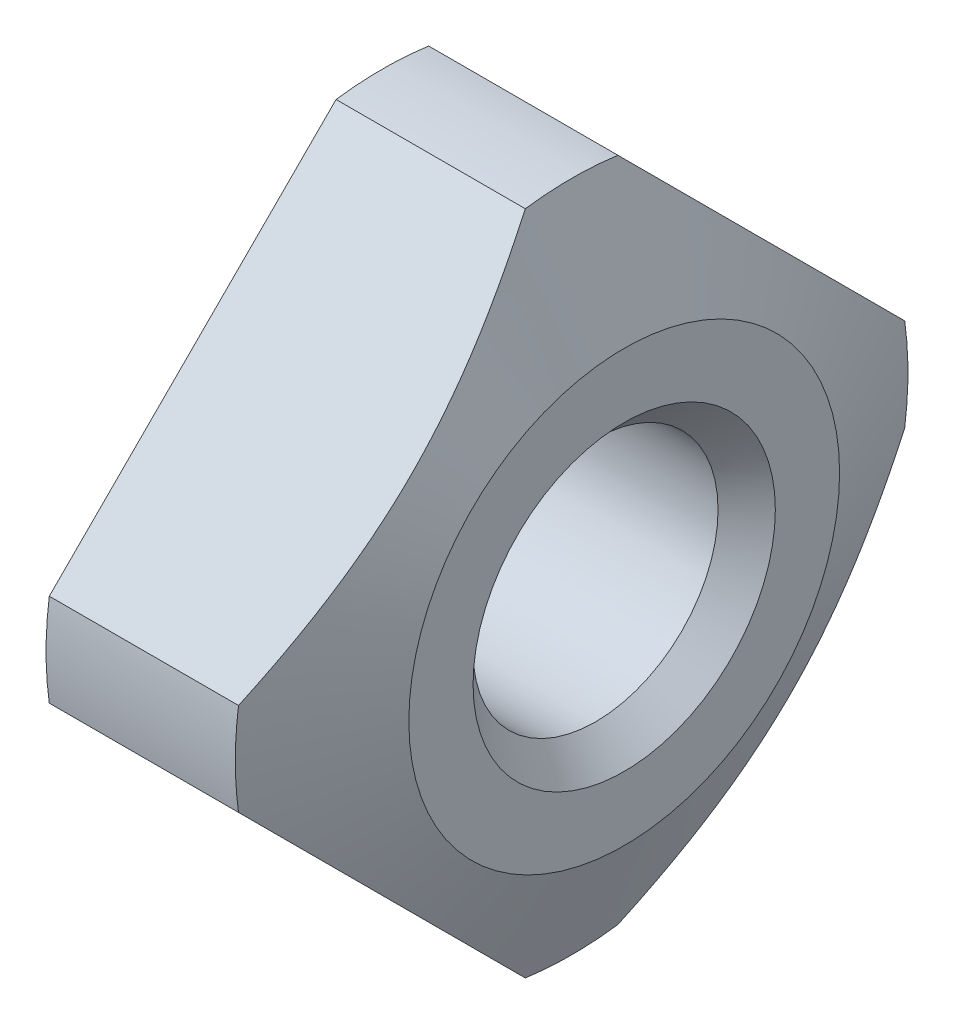
ISO-10303-21;
HEADER;
FILE_DESCRIPTION(('STEP AP214'),'2;1');
FILE_NAME('part.step','',(''),(''),'','','');
FILE_SCHEMA(('AUTOMOTIVE_DESIGN { 1 0 10303 214 1 1 1 1 }'));
ENDSEC;
DATA;
#1=APPLICATION_CONTEXT('core data for automotive mechanical design processes');
#2=APPLICATION_PROTOCOL_DEFINITION('international standard','automotive_design',2000,#1);
#3=PRODUCT_CONTEXT('',#1,'mechanical');
#4=PRODUCT('Part','Part','',(#3));
#5=PRODUCT_RELATED_PRODUCT_CATEGORY('part','',(#4));
#6=PRODUCT_DEFINITION_FORMATION('','',#4);
#7=PRODUCT_DEFINITION_CONTEXT('part definition',#1,'design');
#8=PRODUCT_DEFINITION('design','',#6,#7);
#9=PRODUCT_DEFINITION_SHAPE('','',#8);
#10=(LENGTH_UNIT() NAMED_UNIT(*) SI_UNIT(.MILLI.,.METRE.));
#11=(NAMED_UNIT(*) PLANE_ANGLE_UNIT() SI_UNIT($,.RADIAN.));
#12=(NAMED_UNIT(*) SI_UNIT($,.STERADIAN.) SOLID_ANGLE_UNIT());
#13=UNCERTAINTY_MEASURE_WITH_UNIT(LENGTH_MEASURE(1.E-05),#10,'distance_accuracy_value','');
#14=(GEOMETRIC_REPRESENTATION_CONTEXT(3) GLOBAL_UNCERTAINTY_ASSIGNED_CONTEXT((#13)) GLOBAL_UNIT_ASSIGNED_CONTEXT((#10,
#11,#12)) REPRESENTATION_CONTEXT('',''));
#15=CARTESIAN_POINT('',(0.,0.,0.));
#16=DIRECTION('',(0.,0.,1.));
#17=DIRECTION('',(1.,0.,0.));
#18=AXIS2_PLACEMENT_3D('',#15,#16,#17);
#19=CARTESIAN_POINT('',(0.,0.,0.));
#20=DIRECTION('',(1.,0.,0.));
#21=DIRECTION('',(0.,0.,-1.));
#22=AXIS2_PLACEMENT_3D('',#19,#20,#21);
#23=PLANE('',#22);
#24=CARTESIAN_POINT('',(0.,0.,0.));
#25=DIRECTION('',(-1.,0.,0.));
#26=DIRECTION('',(0.,0.,1.));
#27=AXIS2_PLACEMENT_3D('',#24,#25,#26);
#28=CIRCLE('',#27,2.);
#29=CARTESIAN_POINT('',(0.,0.,2.));
#30=VERTEX_POINT('',#29);
#31=EDGE_CURVE('E192',#30,#30,#28,.T.);
#32=ORIENTED_EDGE('',*,*,#31,.F.);
#33=EDGE_LOOP('',(#32));
#34=FACE_BOUND('',#33,.T.);
#35=DIRECTION('',(0.,0.707106781186548,-0.707106781186548));
#36=VECTOR('',#35,1.);
#37=CARTESIAN_POINT('',(0.,-5.0204581464245,0.));
#38=LINE('',#37,#36);
#39=CARTESIAN_POINT('',(0.,-4.40759566931327,-0.612862477111231));
#40=VERTEX_POINT('',#39);
#41=CARTESIAN_POINT('',(0.,-0.612862477111231,-4.40759566931327));
#42=VERTEX_POINT('',#41);
#43=EDGE_CURVE('E127',#40,#42,#38,.T.);
#44=ORIENTED_EDGE('',*,*,#43,.F.);
#45=CARTESIAN_POINT('',(0.,0.,0.));
#46=DIRECTION('',(1.,0.,0.));
#47=DIRECTION('',(0.,0.,-1.));
#48=AXIS2_PLACEMENT_3D('',#45,#46,#47);
#49=CIRCLE('',#48,4.45);
#50=CARTESIAN_POINT('',(0.,-4.40759566931327,0.612862477111231));
#51=VERTEX_POINT('',#50);
#52=EDGE_CURVE('E111',#51,#40,#49,.T.);
#53=ORIENTED_EDGE('',*,*,#52,.F.);
#54=DIRECTION('',(0.,-0.707106781186548,-0.707106781186548));
#55=VECTOR('',#54,1.);
#56=CARTESIAN_POINT('',(0.,0.,5.0204581464245));
#57=LINE('',#56,#55);
#58=CARTESIAN_POINT('',(0.,-0.612862477111231,4.40759566931327));
#59=VERTEX_POINT('',#58);
#60=EDGE_CURVE('E131',#59,#51,#57,.T.);
#61=ORIENTED_EDGE('',*,*,#60,.F.);
#62=CARTESIAN_POINT('',(0.,0.612862477111231,4.40759566931327));
#63=VERTEX_POINT('',#62);
#64=EDGE_CURVE('E191',#63,#59,#49,.T.);
#65=ORIENTED_EDGE('',*,*,#64,.F.);
#66=DIRECTION('',(0.,-0.707106781186548,0.707106781186548));
#67=VECTOR('',#66,1.);
#68=CARTESIAN_POINT('',(0.,5.0204581464245,0.));
#69=LINE('',#68,#67);
#70=CARTESIAN_POINT('',(0.,4.40759566931327,0.61286247711123));
#71=VERTEX_POINT('',#70);
#72=EDGE_CURVE('E186',#71,#63,#69,.T.);
#73=ORIENTED_EDGE('',*,*,#72,.F.);
#74=CARTESIAN_POINT('',(0.,4.40759566931327,-0.612862477111231));
#75=VERTEX_POINT('',#74);
#76=EDGE_CURVE('E113',#75,#71,#49,.T.);
#77=ORIENTED_EDGE('',*,*,#76,.F.);
#78=DIRECTION('',(0.,0.707106781186548,0.707106781186548));
#79=VECTOR('',#78,1.);
#80=CARTESIAN_POINT('',(0.,0.,-5.0204581464245));
#81=LINE('',#80,#79);
#82=CARTESIAN_POINT('',(0.,0.612862477111231,-4.40759566931327));
#83=VERTEX_POINT('',#82);
#84=EDGE_CURVE('E119',#83,#75,#81,.T.);
#85=ORIENTED_EDGE('',*,*,#84,.F.);
#86=EDGE_CURVE('E102',#42,#83,#49,.T.);
#87=ORIENTED_EDGE('',*,*,#86,.F.);
#88=EDGE_LOOP('',(#44,#53,#61,#65,#73,#77,#85,#87));
#89=FACE_BOUND('',#88,.T.);
#90=ADVANCED_FACE('F40',(#34,#89),#23,.F.);
#91=CARTESIAN_POINT('',(3.2,0.,0.));
#92=DIRECTION('',(-1.,0.,0.));
#93=DIRECTION('',(0.,0.,1.));
#94=AXIS2_PLACEMENT_3D('',#91,#92,#93);
#95=CONICAL_SURFACE('',#94,2.85,1.16064395257621);
#96=CARTESIAN_POINT('',(2.2868038164877,-0.0707564183643917,4.94970172806011));
#97=CARTESIAN_POINT('',(2.33172124276132,-0.175629833543289,4.84482831288121));
#98=CARTESIAN_POINT('',(2.37532571884489,-0.280797737176564,4.73966040924793));
#99=CARTESIAN_POINT('',(2.45916884939955,-0.491852861746213,4.52860528467829));
#100=CARTESIAN_POINT('',(2.49940593074332,-0.597740394168269,4.42271775225623));
#101=CARTESIAN_POINT('',(2.57596619918794,-0.810922171027619,4.20953597539688));
#102=CARTESIAN_POINT('',(2.61226375966969,-0.918221062617609,4.10223708380689));
#103=CARTESIAN_POINT('',(2.67968086783493,-1.13362415817683,3.88683398824767));
#104=CARTESIAN_POINT('',(2.71080102582585,-1.24172826565612,3.77872988076838));
#105=CARTESIAN_POINT('',(2.76589660904455,-1.45532814333493,3.56513000308957));
#106=CARTESIAN_POINT('',(2.79006656238547,-1.5607985271657,3.4596596192588));
#107=CARTESIAN_POINT('',(2.83151961411837,-1.77242313199955,3.24803501442495));
#108=CARTESIAN_POINT('',(2.84880278876683,-1.87857734541744,3.14188080100706));
#109=CARTESIAN_POINT('',(2.87556112631255,-2.09106300368001,2.92939514274449));
#110=CARTESIAN_POINT('',(2.88505963709065,-2.19739295304101,2.82306519338349));
#111=CARTESIAN_POINT('',(2.89578467244474,-2.41026098085396,2.61019716557054));
#112=CARTESIAN_POINT('',(2.89701157907088,-2.51679904946591,2.50365909695859));
#113=CARTESIAN_POINT('',(2.89137444268334,-2.72062964431911,2.29982850210539));
#114=CARTESIAN_POINT('',(2.88519481892413,-2.81793200472193,2.20252614170257));
#115=CARTESIAN_POINT('',(2.86617726847336,-3.01220324169428,2.00825490473021));
#116=CARTESIAN_POINT('',(2.85333925440001,-3.10917211387046,1.91128603255404));
#117=CARTESIAN_POINT('',(2.80559871635679,-3.39982544249197,1.62063270393253));
#118=CARTESIAN_POINT('',(2.76148799529713,-3.59277017149895,1.42768797492555));
#119=CARTESIAN_POINT('',(2.68072222571511,-3.88301579977745,1.13744234664705));
#120=CARTESIAN_POINT('',(2.650823433714,-3.98132808053403,1.03913006589047));
#121=CARTESIAN_POINT('',(2.58694571633892,-4.17730290293878,0.843155243485715));
#122=CARTESIAN_POINT('',(2.55296645868319,-4.27496539098846,0.74549275543604));
#123=CARTESIAN_POINT('',(2.48183476044907,-4.46913632719442,0.551321819230081));
#124=CARTESIAN_POINT('',(2.44470058064253,-4.56564816296429,0.454809983460211));
#125=CARTESIAN_POINT('',(2.36767842531259,-4.75808815979791,0.262369986626586));
#126=CARTESIAN_POINT('',(2.32779135446398,-4.85401650144327,0.166441644981227));
#127=CARTESIAN_POINT('',(2.2868038164877,-4.94970172806011,0.0707564183643922));
#128=B_SPLINE_CURVE_WITH_KNOTS('',3,(#96,#97,#98,#99,#100,#101,#102,#103,#104,#105,#106,#107,
#108,#109,#110,#111,#112,#113,#114,#115,#116,#117,#118,#119,#120,#121,#122,#123,#124,#125,#126,
#127),.UNSPECIFIED.,.F.,.F.,(4,2,2,2,2,2,2,2,2,2,2,2,2,2,2,4),(0.,0.464918768833228,
0.930053532708553,1.3980524940809,1.86599624901812,2.31916835039032,2.77233543370117,
3.22413834569543,3.6759203896033,4.08898265577631,4.50205034293433,5.33024224031278,
5.75684749571213,6.1834875141503,6.60780744323681,7.03198858719266),.UNSPECIFIED.);
#129=CARTESIAN_POINT('',(2.50430020006247,-0.612862477111231,4.40759566931327));
#130=VERTEX_POINT('',#129);
#131=CARTESIAN_POINT('',(2.50430020006269,-4.4075956693135,0.612862477111005));
#132=VERTEX_POINT('',#131);
#133=EDGE_CURVE('E169',#130,#132,#128,.T.);
#134=ORIENTED_EDGE('',*,*,#133,.T.);
#135=CARTESIAN_POINT('',(2.50430020006247,0.,0.));
#136=DIRECTION('',(-1.,0.,0.));
#137=DIRECTION('',(0.,0.,1.));
#138=AXIS2_PLACEMENT_3D('',#135,#136,#137);
#139=CIRCLE('',#138,4.45);
#140=CARTESIAN_POINT('',(2.50430020006247,-4.40759566931327,-0.612862477111231));
#141=VERTEX_POINT('',#140);
#142=EDGE_CURVE('E62',#132,#141,#139,.F.);
#143=ORIENTED_EDGE('',*,*,#142,.T.);
#144=CARTESIAN_POINT('',(2.2868038164877,-4.94970172806011,-0.0707564183643917));
#145=CARTESIAN_POINT('',(2.33172124276132,-4.84482831288121,-0.175629833543289));
#146=CARTESIAN_POINT('',(2.37532571884489,-4.73966040924793,-0.280797737176564));
#147=CARTESIAN_POINT('',(2.45916884939955,-4.52860528467829,-0.491852861746213));
#148=CARTESIAN_POINT('',(2.49940593074332,-4.42271775225623,-0.597740394168269));
#149=CARTESIAN_POINT('',(2.57596619918794,-4.20953597539688,-0.810922171027619));
#150=CARTESIAN_POINT('',(2.61226375966969,-4.10223708380689,-0.918221062617609));
#151=CARTESIAN_POINT('',(2.67968086783493,-3.88683398824767,-1.13362415817683));
#152=CARTESIAN_POINT('',(2.71080102582585,-3.77872988076838,-1.24172826565612));
#153=CARTESIAN_POINT('',(2.76589660904455,-3.56513000308957,-1.45532814333493));
#154=CARTESIAN_POINT('',(2.79006656238547,-3.4596596192588,-1.5607985271657));
#155=CARTESIAN_POINT('',(2.83151961411837,-3.24803501442495,-1.77242313199955));
#156=CARTESIAN_POINT('',(2.84880278876683,-3.14188080100706,-1.87857734541744));
#157=CARTESIAN_POINT('',(2.87556112631255,-2.92939514274449,-2.09106300368001));
#158=CARTESIAN_POINT('',(2.88505963709065,-2.82306519338349,-2.19739295304101));
#159=CARTESIAN_POINT('',(2.89578467244474,-2.61019716557054,-2.41026098085396));
#160=CARTESIAN_POINT('',(2.89701157907088,-2.50365909695859,-2.51679904946591));
#161=CARTESIAN_POINT('',(2.89137444268334,-2.29982850210539,-2.72062964431911));
#162=CARTESIAN_POINT('',(2.88519481892413,-2.20252614170257,-2.81793200472193));
#163=CARTESIAN_POINT('',(2.86617726847336,-2.00825490473021,-3.01220324169428));
#164=CARTESIAN_POINT('',(2.85333925440001,-1.91128603255404,-3.10917211387046));
#165=CARTESIAN_POINT('',(2.80559871635679,-1.62063270393253,-3.39982544249197));
#166=CARTESIAN_POINT('',(2.76148799529713,-1.42768797492555,-3.59277017149895));
#167=CARTESIAN_POINT('',(2.68072222571511,-1.13744234664705,-3.88301579977745));
#168=CARTESIAN_POINT('',(2.650823433714,-1.03913006589047,-3.98132808053403));
#169=CARTESIAN_POINT('',(2.58694571633892,-0.843155243485715,-4.17730290293878));
#170=CARTESIAN_POINT('',(2.55296645868319,-0.74549275543604,-4.27496539098846));
#171=CARTESIAN_POINT('',(2.48183476044907,-0.551321819230081,-4.46913632719442));
#172=CARTESIAN_POINT('',(2.44470058064253,-0.454809983460211,-4.56564816296429));
#173=CARTESIAN_POINT('',(2.36767842531259,-0.262369986626586,-4.75808815979791));
#174=CARTESIAN_POINT('',(2.32779135446398,-0.166441644981227,-4.85401650144327));
#175=CARTESIAN_POINT('',(2.2868038164877,-0.0707564183643922,-4.94970172806011));
#176=B_SPLINE_CURVE_WITH_KNOTS('',3,(#144,#145,#146,#147,#148,#149,#150,#151,#152,#153,#154,
#155,#156,#157,#158,#159,#160,#161,#162,#163,#164,#165,#166,#167,#168,#169,#170,#171,#172,#173,
#174,#175),.UNSPECIFIED.,.F.,.F.,(4,2,2,2,2,2,2,2,2,2,2,2,2,2,2,4),(0.,0.464918768833228,
0.930053532708553,1.3980524940809,1.86599624901812,2.31916835039032,2.77233543370117,
3.22413834569543,3.6759203896033,4.08898265577631,4.50205034293433,5.33024224031278,
5.75684749571213,6.1834875141503,6.60780744323681,7.03198858719266),.UNSPECIFIED.);
#177=CARTESIAN_POINT('',(2.50430020006269,-0.612862477111005,-4.4075956693135));
#178=VERTEX_POINT('',#177);
#179=EDGE_CURVE('E141',#141,#178,#176,.T.);
#180=ORIENTED_EDGE('',*,*,#179,.T.);
#181=CARTESIAN_POINT('',(2.50430020006247,0.612862477111231,-4.40759566931327));
#182=VERTEX_POINT('',#181);
#183=EDGE_CURVE('E54',#178,#182,#139,.F.);
#184=ORIENTED_EDGE('',*,*,#183,.T.);
#185=CARTESIAN_POINT('',(2.2868038164877,0.0707564183643917,-4.94970172806011));
#186=CARTESIAN_POINT('',(2.33172124276132,0.175629833543289,-4.84482831288121));
#187=CARTESIAN_POINT('',(2.37532571884489,0.280797737176564,-4.73966040924793));
#188=CARTESIAN_POINT('',(2.45916884939955,0.491852861746213,-4.52860528467829));
#189=CARTESIAN_POINT('',(2.49940593074332,0.597740394168269,-4.42271775225623));
#190=CARTESIAN_POINT('',(2.57596619918794,0.810922171027619,-4.20953597539688));
#191=CARTESIAN_POINT('',(2.61226375966969,0.918221062617609,-4.10223708380689));
#192=CARTESIAN_POINT('',(2.67968086783493,1.13362415817683,-3.88683398824767));
#193=CARTESIAN_POINT('',(2.71080102582585,1.24172826565612,-3.77872988076838));
#194=CARTESIAN_POINT('',(2.76589660904455,1.45532814333493,-3.56513000308957));
#195=CARTESIAN_POINT('',(2.79006656238547,1.5607985271657,-3.4596596192588));
#196=CARTESIAN_POINT('',(2.83151961411837,1.77242313199955,-3.24803501442495));
#197=CARTESIAN_POINT('',(2.84880278876683,1.87857734541744,-3.14188080100706));
#198=CARTESIAN_POINT('',(2.87556112631255,2.09106300368001,-2.92939514274449));
#199=CARTESIAN_POINT('',(2.88505963709065,2.19739295304101,-2.82306519338349));
#200=CARTESIAN_POINT('',(2.89578467244474,2.41026098085396,-2.61019716557054));
#201=CARTESIAN_POINT('',(2.89701157907088,2.51679904946591,-2.50365909695859));
#202=CARTESIAN_POINT('',(2.89137444268334,2.72062964431911,-2.29982850210539));
#203=CARTESIAN_POINT('',(2.88519481892413,2.81793200472193,-2.20252614170257));
#204=CARTESIAN_POINT('',(2.86617726847336,3.01220324169428,-2.00825490473021));
#205=CARTESIAN_POINT('',(2.85333925440001,3.10917211387046,-1.91128603255404));
#206=CARTESIAN_POINT('',(2.80559871635679,3.39982544249197,-1.62063270393253));
#207=CARTESIAN_POINT('',(2.76148799529713,3.59277017149895,-1.42768797492555));
#208=CARTESIAN_POINT('',(2.68072222571511,3.88301579977745,-1.13744234664705));
#209=CARTESIAN_POINT('',(2.650823433714,3.98132808053403,-1.03913006589047));
#210=CARTESIAN_POINT('',(2.58694571633892,4.17730290293878,-0.843155243485715));
#211=CARTESIAN_POINT('',(2.55296645868319,4.27496539098846,-0.74549275543604));
#212=CARTESIAN_POINT('',(2.48183476044907,4.46913632719442,-0.551321819230081));
#213=CARTESIAN_POINT('',(2.44470058064253,4.56564816296429,-0.454809983460211));
#214=CARTESIAN_POINT('',(2.36767842531259,4.75808815979791,-0.262369986626586));
#215=CARTESIAN_POINT('',(2.32779135446398,4.85401650144327,-0.166441644981227));
#216=CARTESIAN_POINT('',(2.2868038164877,4.94970172806011,-0.0707564183643922));
#217=B_SPLINE_CURVE_WITH_KNOTS('',3,(#185,#186,#187,#188,#189,#190,#191,#192,#193,#194,#195,
#196,#197,#198,#199,#200,#201,#202,#203,#204,#205,#206,#207,#208,#209,#210,#211,#212,#213,#214,
#215,#216),.UNSPECIFIED.,.F.,.F.,(4,2,2,2,2,2,2,2,2,2,2,2,2,2,2,4),(0.,0.464918768833228,
0.930053532708553,1.3980524940809,1.86599624901812,2.31916835039032,2.77233543370117,
3.22413834569543,3.6759203896033,4.08898265577631,4.50205034293433,5.33024224031278,
5.75684749571213,6.1834875141503,6.60780744323681,7.03198858719266),.UNSPECIFIED.);
#218=CARTESIAN_POINT('',(2.50430020006247,4.40759566931327,-0.612862477111231));
#219=VERTEX_POINT('',#218);
#220=EDGE_CURVE('E121',#182,#219,#217,.T.);
#221=ORIENTED_EDGE('',*,*,#220,.T.);
#222=CARTESIAN_POINT('',(2.50430020006247,4.40759566931327,0.612862477111231));
#223=VERTEX_POINT('',#222);
#224=EDGE_CURVE('E218',#219,#223,#139,.F.);
#225=ORIENTED_EDGE('',*,*,#224,.T.);
#226=CARTESIAN_POINT('',(2.2868038164877,4.94970172806011,0.0707564183643917));
#227=CARTESIAN_POINT('',(2.33172124276132,4.84482831288121,0.175629833543289));
#228=CARTESIAN_POINT('',(2.37532571884489,4.73966040924793,0.280797737176564));
#229=CARTESIAN_POINT('',(2.45916884939955,4.52860528467829,0.491852861746213));
#230=CARTESIAN_POINT('',(2.49940593074332,4.42271775225623,0.597740394168269));
#231=CARTESIAN_POINT('',(2.57596619918794,4.20953597539688,0.810922171027619));
#232=CARTESIAN_POINT('',(2.61226375966969,4.10223708380689,0.918221062617609));
#233=CARTESIAN_POINT('',(2.67968086783493,3.88683398824767,1.13362415817683));
#234=CARTESIAN_POINT('',(2.71080102582585,3.77872988076838,1.24172826565612));
#235=CARTESIAN_POINT('',(2.76589660904455,3.56513000308957,1.45532814333493));
#236=CARTESIAN_POINT('',(2.79006656238547,3.4596596192588,1.5607985271657));
#237=CARTESIAN_POINT('',(2.83151961411837,3.24803501442495,1.77242313199955));
#238=CARTESIAN_POINT('',(2.84880278876683,3.14188080100706,1.87857734541744));
#239=CARTESIAN_POINT('',(2.87556112631255,2.92939514274449,2.09106300368001));
#240=CARTESIAN_POINT('',(2.88505963709065,2.82306519338349,2.19739295304101));
#241=CARTESIAN_POINT('',(2.89578467244474,2.61019716557054,2.41026098085396));
#242=CARTESIAN_POINT('',(2.89701157907088,2.50365909695859,2.51679904946591));
#243=CARTESIAN_POINT('',(2.89137444268334,2.29982850210539,2.72062964431911));
#244=CARTESIAN_POINT('',(2.88519481892413,2.20252614170257,2.81793200472193));
#245=CARTESIAN_POINT('',(2.86617726847336,2.00825490473021,3.01220324169428));
#246=CARTESIAN_POINT('',(2.85333925440001,1.91128603255404,3.10917211387046));
#247=CARTESIAN_POINT('',(2.80559871635679,1.62063270393253,3.39982544249197));
#248=CARTESIAN_POINT('',(2.76148799529713,1.42768797492555,3.59277017149895));
#249=CARTESIAN_POINT('',(2.68072222571511,1.13744234664705,3.88301579977745));
#250=CARTESIAN_POINT('',(2.650823433714,1.03913006589047,3.98132808053403));
#251=CARTESIAN_POINT('',(2.58694571633892,0.843155243485715,4.17730290293878));
#252=CARTESIAN_POINT('',(2.55296645868319,0.74549275543604,4.27496539098846));
#253=CARTESIAN_POINT('',(2.48183476044907,0.551321819230081,4.46913632719442));
#254=CARTESIAN_POINT('',(2.44470058064253,0.454809983460211,4.56564816296429));
#255=CARTESIAN_POINT('',(2.36767842531259,0.262369986626586,4.75808815979791));
#256=CARTESIAN_POINT('',(2.32779135446398,0.166441644981227,4.85401650144327));
#257=CARTESIAN_POINT('',(2.2868038164877,0.0707564183643922,4.94970172806011));
#258=B_SPLINE_CURVE_WITH_KNOTS('',3,(#226,#227,#228,#229,#230,#231,#232,#233,#234,#235,#236,
#237,#238,#239,#240,#241,#242,#243,#244,#245,#246,#247,#248,#249,#250,#251,#252,#253,#254,#255,
#256,#257),.UNSPECIFIED.,.F.,.F.,(4,2,2,2,2,2,2,2,2,2,2,2,2,2,2,4),(0.,0.464918768833228,
0.930053532708553,1.3980524940809,1.86599624901812,2.31916835039032,2.77233543370117,
3.22413834569543,3.6759203896033,4.08898265577631,4.50205034293433,5.33024224031278,
5.75684749571213,6.1834875141503,6.60780744323681,7.03198858719266),.UNSPECIFIED.);
#259=CARTESIAN_POINT('',(2.50430020006269,0.612862477111005,4.4075956693135));
#260=VERTEX_POINT('',#259);
#261=EDGE_CURVE('E176',#223,#260,#258,.T.);
#262=ORIENTED_EDGE('',*,*,#261,.T.);
#263=EDGE_CURVE('E215',#260,#130,#139,.F.);
#264=ORIENTED_EDGE('',*,*,#263,.T.);
#265=EDGE_LOOP('',(#134,#143,#180,#184,#221,#225,#262,#264));
#266=FACE_BOUND('',#265,.T.);
#267=CARTESIAN_POINT('',(3.2,0.,0.));
#268=DIRECTION('',(-1.,0.,0.));
#269=DIRECTION('',(0.,0.,1.));
#270=AXIS2_PLACEMENT_3D('',#267,#268,#269);
#271=CIRCLE('',#270,2.85);
#272=CARTESIAN_POINT('',(3.2,0.,2.85));
#273=VERTEX_POINT('',#272);
#274=EDGE_CURVE('E126',#273,#273,#271,.T.);
#275=ORIENTED_EDGE('',*,*,#274,.T.);
#276=EDGE_LOOP('',(#275));
#277=FACE_BOUND('',#276,.T.);
#278=ADVANCED_FACE('F148',(#266,#277),#95,.T.);
#279=CARTESIAN_POINT('',(3.2,2.85,0.));
#280=DIRECTION('',(-1.,0.,0.));
#281=DIRECTION('',(0.,0.,1.));
#282=AXIS2_PLACEMENT_3D('',#279,#280,#281);
#283=PLANE('',#282);
#284=CARTESIAN_POINT('',(3.2,0.,0.));
#285=DIRECTION('',(-1.,0.,0.));
#286=DIRECTION('',(0.,0.,1.));
#287=AXIS2_PLACEMENT_3D('',#284,#285,#286);
#288=CIRCLE('',#287,2.);
#289=CARTESIAN_POINT('',(3.2,0.,2.));
#290=VERTEX_POINT('',#289);
#291=EDGE_CURVE('E122',#290,#290,#288,.T.);
#292=ORIENTED_EDGE('',*,*,#291,.T.);
#293=EDGE_LOOP('',(#292));
#294=FACE_BOUND('',#293,.T.);
#295=ORIENTED_EDGE('',*,*,#274,.F.);
#296=EDGE_LOOP('',(#295));
#297=FACE_BOUND('',#296,.T.);
#298=ADVANCED_FACE('F155',(#294,#297),#283,.F.);
#299=CARTESIAN_POINT('',(3.2,0.,-5.0204581464245));
#300=DIRECTION('',(0.,-0.707106781186548,0.707106781186548));
#301=DIRECTION('',(0.,-0.707106781186548,-0.707106781186548));
#302=AXIS2_PLACEMENT_3D('',#299,#300,#301);
#303=PLANE('',#302);
#304=ORIENTED_EDGE('',*,*,#84,.T.);
#305=DIRECTION('',(-1.,0.,0.));
#306=VECTOR('',#305,1.);
#307=CARTESIAN_POINT('',(3.2,4.40759566931327,-0.612862477111231));
#308=LINE('',#307,#306);
#309=EDGE_CURVE('E216',#75,#219,#308,.F.);
#310=ORIENTED_EDGE('',*,*,#309,.T.);
#311=ORIENTED_EDGE('',*,*,#220,.F.);
#312=DIRECTION('',(-1.,0.,0.));
#313=VECTOR('',#312,1.);
#314=CARTESIAN_POINT('',(3.2,0.612862477111231,-4.40759566931327));
#315=LINE('',#314,#313);
#316=EDGE_CURVE('E105',#182,#83,#315,.T.);
#317=ORIENTED_EDGE('',*,*,#316,.T.);
#318=EDGE_LOOP('',(#304,#310,#311,#317));
#319=FACE_BOUND('',#318,.T.);
#320=ADVANCED_FACE('F117',(#319),#303,.F.);
#321=CARTESIAN_POINT('',(3.2,-5.0204581464245,0.));
#322=DIRECTION('',(0.,0.707106781186548,0.707106781186548));
#323=DIRECTION('',(0.,-0.707106781186548,0.707106781186548));
#324=AXIS2_PLACEMENT_3D('',#321,#322,#323);
#325=PLANE('',#324);
#326=ORIENTED_EDGE('',*,*,#43,.T.);
#327=DIRECTION('',(-1.,0.,0.));
#328=VECTOR('',#327,1.);
#329=CARTESIAN_POINT('',(3.2,-0.612862477111231,-4.40759566931327));
#330=LINE('',#329,#328);
#331=EDGE_CURVE('E106',#42,#178,#330,.F.);
#332=ORIENTED_EDGE('',*,*,#331,.T.);
#333=ORIENTED_EDGE('',*,*,#179,.F.);
#334=DIRECTION('',(-1.,0.,0.));
#335=VECTOR('',#334,1.);
#336=CARTESIAN_POINT('',(3.2,-4.40759566931327,-0.612862477111231));
#337=LINE('',#336,#335);
#338=EDGE_CURVE('E207',#141,#40,#337,.T.);
#339=ORIENTED_EDGE('',*,*,#338,.T.);
#340=EDGE_LOOP('',(#326,#332,#333,#339));
#341=FACE_BOUND('',#340,.T.);
#342=ADVANCED_FACE('F154',(#341),#325,.F.);
#343=CARTESIAN_POINT('',(3.2,0.,5.0204581464245));
#344=DIRECTION('',(0.,0.707106781186548,-0.707106781186548));
#345=DIRECTION('',(0.,0.707106781186548,0.707106781186548));
#346=AXIS2_PLACEMENT_3D('',#343,#344,#345);
#347=PLANE('',#346);
#348=ORIENTED_EDGE('',*,*,#60,.T.);
#349=DIRECTION('',(-1.,0.,0.));
#350=VECTOR('',#349,1.);
#351=CARTESIAN_POINT('',(3.2,-4.40759566931327,0.612862477111231));
#352=LINE('',#351,#350);
#353=EDGE_CURVE('E210',#51,#132,#352,.F.);
#354=ORIENTED_EDGE('',*,*,#353,.T.);
#355=ORIENTED_EDGE('',*,*,#133,.F.);
#356=DIRECTION('',(-1.,0.,0.));
#357=VECTOR('',#356,1.);
#358=CARTESIAN_POINT('',(3.2,-0.612862477111231,4.40759566931327));
#359=LINE('',#358,#357);
#360=EDGE_CURVE('E212',#130,#59,#359,.T.);
#361=ORIENTED_EDGE('',*,*,#360,.T.);
#362=EDGE_LOOP('',(#348,#354,#355,#361));
#363=FACE_BOUND('',#362,.T.);
#364=ADVANCED_FACE('F161',(#363),#347,.F.);
#365=CARTESIAN_POINT('',(3.2,5.0204581464245,0.));
#366=DIRECTION('',(0.,-0.707106781186548,-0.707106781186548));
#367=DIRECTION('',(0.,0.707106781186548,-0.707106781186548));
#368=AXIS2_PLACEMENT_3D('',#365,#366,#367);
#369=PLANE('',#368);
#370=ORIENTED_EDGE('',*,*,#72,.T.);
#371=DIRECTION('',(-1.,0.,0.));
#372=VECTOR('',#371,1.);
#373=CARTESIAN_POINT('',(3.2,0.612862477111231,4.40759566931327));
#374=LINE('',#373,#372);
#375=EDGE_CURVE('E11',#63,#260,#374,.F.);
#376=ORIENTED_EDGE('',*,*,#375,.T.);
#377=ORIENTED_EDGE('',*,*,#261,.F.);
#378=DIRECTION('',(-1.,0.,0.));
#379=VECTOR('',#378,1.);
#380=CARTESIAN_POINT('',(3.2,4.40759566931327,0.612862477111231));
#381=LINE('',#380,#379);
#382=EDGE_CURVE('E47',#223,#71,#381,.T.);
#383=ORIENTED_EDGE('',*,*,#382,.T.);
#384=EDGE_LOOP('',(#370,#376,#377,#383));
#385=FACE_BOUND('',#384,.T.);
#386=ADVANCED_FACE('F166',(#385),#369,.F.);
#387=CARTESIAN_POINT('',(0.379,0.,0.));
#388=DIRECTION('',(-1.,0.,0.));
#389=DIRECTION('',(0.,0.,1.));
#390=AXIS2_PLACEMENT_3D('',#387,#388,#389);
#391=CONICAL_SURFACE('',#390,1.621,0.785398163397448);
#392=ORIENTED_EDGE('',*,*,#31,.T.);
#393=EDGE_LOOP('',(#392));
#394=FACE_BOUND('',#393,.T.);
#395=CARTESIAN_POINT('',(0.379,0.,0.));
#396=DIRECTION('',(-1.,0.,0.));
#397=DIRECTION('',(0.,0.,1.));
#398=AXIS2_PLACEMENT_3D('',#395,#396,#397);
#399=CIRCLE('',#398,1.621);
#400=CARTESIAN_POINT('',(0.379,0.,1.621));
#401=VERTEX_POINT('',#400);
#402=EDGE_CURVE('E196',#401,#401,#399,.T.);
#403=ORIENTED_EDGE('',*,*,#402,.F.);
#404=EDGE_LOOP('',(#403));
#405=FACE_BOUND('',#404,.T.);
#406=ADVANCED_FACE('F156',(#394,#405),#391,.F.);
#407=CARTESIAN_POINT('',(3.2,0.,0.));
#408=DIRECTION('',(-1.,0.,0.));
#409=DIRECTION('',(0.,0.,1.));
#410=AXIS2_PLACEMENT_3D('',#407,#408,#409);
#411=CYLINDRICAL_SURFACE('',#410,1.621);
#412=ORIENTED_EDGE('',*,*,#402,.T.);
#413=EDGE_LOOP('',(#412));
#414=FACE_BOUND('',#413,.T.);
#415=CARTESIAN_POINT('',(2.821,0.,0.));
#416=DIRECTION('',(-1.,0.,0.));
#417=DIRECTION('',(0.,0.,1.));
#418=AXIS2_PLACEMENT_3D('',#415,#416,#417);
#419=CIRCLE('',#418,1.621);
#420=CARTESIAN_POINT('',(2.821,0.,1.621));
#421=VERTEX_POINT('',#420);
#422=EDGE_CURVE('E201',#421,#421,#419,.T.);
#423=ORIENTED_EDGE('',*,*,#422,.F.);
#424=EDGE_LOOP('',(#423));
#425=FACE_BOUND('',#424,.T.);
#426=ADVANCED_FACE('F247',(#414,#425),#411,.F.);
#427=CARTESIAN_POINT('',(3.2,0.,0.));
#428=DIRECTION('',(1.,0.,0.));
#429=DIRECTION('',(0.,0.,-1.));
#430=AXIS2_PLACEMENT_3D('',#427,#428,#429);
#431=CONICAL_SURFACE('',#430,2.,0.785398163397448);
#432=ORIENTED_EDGE('',*,*,#422,.T.);
#433=EDGE_LOOP('',(#432));
#434=FACE_BOUND('',#433,.T.);
#435=ORIENTED_EDGE('',*,*,#291,.F.);
#436=EDGE_LOOP('',(#435));
#437=FACE_BOUND('',#436,.T.);
#438=ADVANCED_FACE('F236',(#434,#437),#431,.F.);
#439=CARTESIAN_POINT('',(3.2,0.,0.));
#440=DIRECTION('',(-1.,0.,0.));
#441=DIRECTION('',(0.,0.,1.));
#442=AXIS2_PLACEMENT_3D('',#439,#440,#441);
#443=CYLINDRICAL_SURFACE('',#442,4.45);
#444=ORIENTED_EDGE('',*,*,#76,.T.);
#445=ORIENTED_EDGE('',*,*,#382,.F.);
#446=ORIENTED_EDGE('',*,*,#224,.F.);
#447=ORIENTED_EDGE('',*,*,#309,.F.);
#448=EDGE_LOOP('',(#444,#445,#446,#447));
#449=FACE_BOUND('',#448,.T.);
#450=ADVANCED_FACE('F230',(#449),#443,.T.);
#451=ORIENTED_EDGE('',*,*,#263,.F.);
#452=ORIENTED_EDGE('',*,*,#375,.F.);
#453=ORIENTED_EDGE('',*,*,#64,.T.);
#454=ORIENTED_EDGE('',*,*,#360,.F.);
#455=EDGE_LOOP('',(#451,#452,#453,#454));
#456=FACE_BOUND('',#455,.T.);
#457=ADVANCED_FACE('F227',(#456),#443,.T.);
#458=ORIENTED_EDGE('',*,*,#142,.F.);
#459=ORIENTED_EDGE('',*,*,#353,.F.);
#460=ORIENTED_EDGE('',*,*,#52,.T.);
#461=ORIENTED_EDGE('',*,*,#338,.F.);
#462=EDGE_LOOP('',(#458,#459,#460,#461));
#463=FACE_BOUND('',#462,.T.);
#464=ADVANCED_FACE('F229',(#463),#443,.T.);
#465=ORIENTED_EDGE('',*,*,#183,.F.);
#466=ORIENTED_EDGE('',*,*,#331,.F.);
#467=ORIENTED_EDGE('',*,*,#86,.T.);
#468=ORIENTED_EDGE('',*,*,#316,.F.);
#469=EDGE_LOOP('',(#465,#466,#467,#468));
#470=FACE_BOUND('',#469,.T.);
#471=ADVANCED_FACE('F104',(#470),#443,.T.);
#472=CLOSED_SHELL('',(#90,#278,#298,#320,#342,#364,#386,#406,#426,#438,#450,#457,#464,#471));
#473=MANIFOLD_SOLID_BREP('B2',#472);
#474=ADVANCED_BREP_SHAPE_REPRESENTATION('',(#18,#473),#14);
#475=SHAPE_DEFINITION_REPRESENTATION(#9,#474);
ENDSEC;
END-ISO-10303-21;
